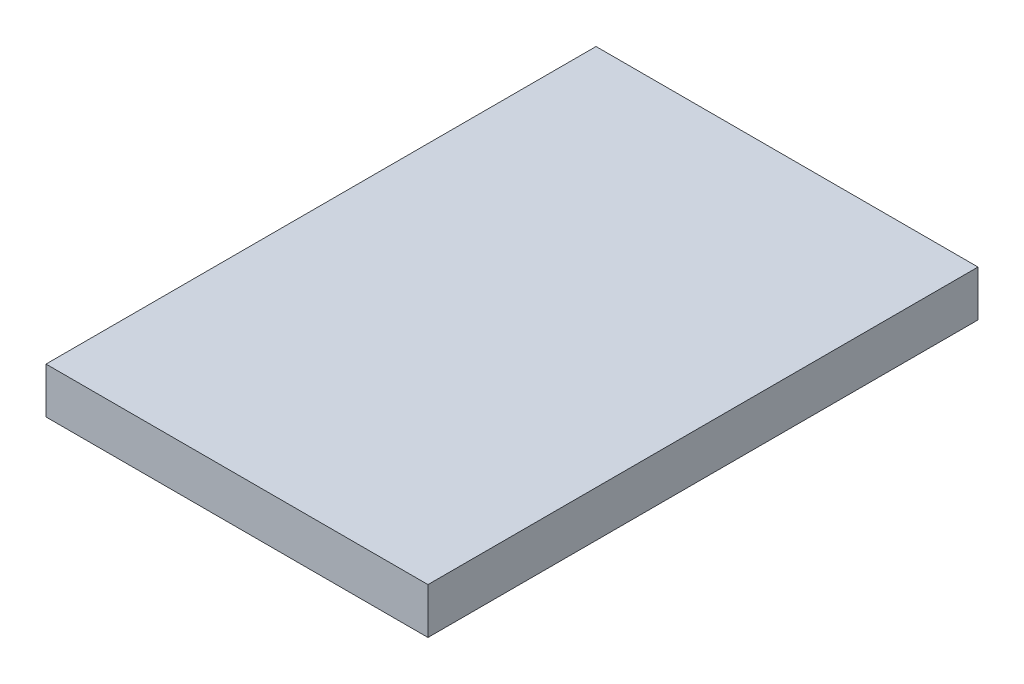
ISO-10303-21;
HEADER;
FILE_DESCRIPTION(('STEP AP214'),'2;1');
FILE_NAME('part.step','',(''),(''),'','','');
FILE_SCHEMA(('AUTOMOTIVE_DESIGN { 1 0 10303 214 1 1 1 1 }'));
ENDSEC;
DATA;
#1=APPLICATION_CONTEXT('core data for automotive mechanical design processes');
#2=APPLICATION_PROTOCOL_DEFINITION('international standard','automotive_design',2000,#1);
#3=PRODUCT_CONTEXT('',#1,'mechanical');
#4=PRODUCT('Part','Part','',(#3));
#5=PRODUCT_RELATED_PRODUCT_CATEGORY('part','',(#4));
#6=PRODUCT_DEFINITION_FORMATION('','',#4);
#7=PRODUCT_DEFINITION_CONTEXT('part definition',#1,'design');
#8=PRODUCT_DEFINITION('design','',#6,#7);
#9=PRODUCT_DEFINITION_SHAPE('','',#8);
#10=(LENGTH_UNIT() NAMED_UNIT(*) SI_UNIT(.MILLI.,.METRE.));
#11=(NAMED_UNIT(*) PLANE_ANGLE_UNIT() SI_UNIT($,.RADIAN.));
#12=(NAMED_UNIT(*) SI_UNIT($,.STERADIAN.) SOLID_ANGLE_UNIT());
#13=UNCERTAINTY_MEASURE_WITH_UNIT(LENGTH_MEASURE(1.E-05),#10,'distance_accuracy_value','');
#14=(GEOMETRIC_REPRESENTATION_CONTEXT(3) GLOBAL_UNCERTAINTY_ASSIGNED_CONTEXT((#13)) GLOBAL_UNIT_ASSIGNED_CONTEXT((#10,
#11,#12)) REPRESENTATION_CONTEXT('',''));
#15=CARTESIAN_POINT('',(0.,0.,0.));
#16=DIRECTION('',(0.,0.,1.));
#17=DIRECTION('',(1.,0.,0.));
#18=AXIS2_PLACEMENT_3D('',#15,#16,#17);
#19=CARTESIAN_POINT('',(12.5,3.,-18.));
#20=DIRECTION('',(-1.,0.,0.));
#21=DIRECTION('',(0.,0.,1.));
#22=AXIS2_PLACEMENT_3D('',#19,#20,#21);
#23=PLANE('',#22);
#24=DIRECTION('',(0.,0.,-1.));
#25=VECTOR('',#24,1.);
#26=CARTESIAN_POINT('',(12.5,0.,-18.));
#27=LINE('',#26,#25);
#28=CARTESIAN_POINT('',(12.5,0.,18.));
#29=VERTEX_POINT('',#28);
#30=CARTESIAN_POINT('',(12.5,0.,-18.));
#31=VERTEX_POINT('',#30);
#32=EDGE_CURVE('E98',#29,#31,#27,.T.);
#33=ORIENTED_EDGE('',*,*,#32,.T.);
#34=DIRECTION('',(0.,-1.,0.));
#35=VECTOR('',#34,1.);
#36=CARTESIAN_POINT('',(12.5,3.,-18.));
#37=LINE('',#36,#35);
#38=CARTESIAN_POINT('',(12.5,3.,-18.));
#39=VERTEX_POINT('',#38);
#40=EDGE_CURVE('E11',#39,#31,#37,.T.);
#41=ORIENTED_EDGE('',*,*,#40,.F.);
#42=DIRECTION('',(0.,0.,-1.));
#43=VECTOR('',#42,1.);
#44=CARTESIAN_POINT('',(12.5,3.,-18.));
#45=LINE('',#44,#43);
#46=CARTESIAN_POINT('',(12.5,3.,18.));
#47=VERTEX_POINT('',#46);
#48=EDGE_CURVE('E86',#47,#39,#45,.T.);
#49=ORIENTED_EDGE('',*,*,#48,.F.);
#50=DIRECTION('',(0.,-1.,0.));
#51=VECTOR('',#50,1.);
#52=CARTESIAN_POINT('',(12.5,3.,18.));
#53=LINE('',#52,#51);
#54=EDGE_CURVE('E94',#47,#29,#53,.T.);
#55=ORIENTED_EDGE('',*,*,#54,.T.);
#56=EDGE_LOOP('',(#33,#41,#49,#55));
#57=FACE_BOUND('',#56,.T.);
#58=ADVANCED_FACE('F35',(#57),#23,.F.);
#59=CARTESIAN_POINT('',(-12.5,3.,-18.));
#60=DIRECTION('',(0.,0.,1.));
#61=DIRECTION('',(1.,0.,0.));
#62=AXIS2_PLACEMENT_3D('',#59,#60,#61);
#63=PLANE('',#62);
#64=DIRECTION('',(-1.,0.,0.));
#65=VECTOR('',#64,1.);
#66=CARTESIAN_POINT('',(-12.5,0.,-18.));
#67=LINE('',#66,#65);
#68=CARTESIAN_POINT('',(-12.5,0.,-18.));
#69=VERTEX_POINT('',#68);
#70=EDGE_CURVE('E90',#31,#69,#67,.T.);
#71=ORIENTED_EDGE('',*,*,#70,.T.);
#72=DIRECTION('',(0.,-1.,0.));
#73=VECTOR('',#72,1.);
#74=CARTESIAN_POINT('',(-12.5,3.,-18.));
#75=LINE('',#74,#73);
#76=CARTESIAN_POINT('',(-12.5,3.,-18.));
#77=VERTEX_POINT('',#76);
#78=EDGE_CURVE('E43',#77,#69,#75,.T.);
#79=ORIENTED_EDGE('',*,*,#78,.F.);
#80=DIRECTION('',(-1.,0.,0.));
#81=VECTOR('',#80,1.);
#82=CARTESIAN_POINT('',(-12.5,3.,-18.));
#83=LINE('',#82,#81);
#84=EDGE_CURVE('E81',#39,#77,#83,.T.);
#85=ORIENTED_EDGE('',*,*,#84,.F.);
#86=ORIENTED_EDGE('',*,*,#40,.T.);
#87=EDGE_LOOP('',(#71,#79,#85,#86));
#88=FACE_BOUND('',#87,.T.);
#89=ADVANCED_FACE('F89',(#88),#63,.F.);
#90=CARTESIAN_POINT('',(-12.5,3.,-18.));
#91=DIRECTION('',(1.,0.,0.));
#92=DIRECTION('',(0.,0.,-1.));
#93=AXIS2_PLACEMENT_3D('',#90,#91,#92);
#94=PLANE('',#93);
#95=DIRECTION('',(0.,0.,1.));
#96=VECTOR('',#95,1.);
#97=CARTESIAN_POINT('',(-12.5,0.,-18.));
#98=LINE('',#97,#96);
#99=CARTESIAN_POINT('',(-12.5,0.,18.));
#100=VERTEX_POINT('',#99);
#101=EDGE_CURVE('E68',#69,#100,#98,.T.);
#102=ORIENTED_EDGE('',*,*,#101,.T.);
#103=DIRECTION('',(0.,-1.,0.));
#104=VECTOR('',#103,1.);
#105=CARTESIAN_POINT('',(-12.5,3.,18.));
#106=LINE('',#105,#104);
#107=CARTESIAN_POINT('',(-12.5,3.,18.));
#108=VERTEX_POINT('',#107);
#109=EDGE_CURVE('E91',#108,#100,#106,.T.);
#110=ORIENTED_EDGE('',*,*,#109,.F.);
#111=DIRECTION('',(0.,0.,1.));
#112=VECTOR('',#111,1.);
#113=CARTESIAN_POINT('',(-12.5,3.,-18.));
#114=LINE('',#113,#112);
#115=EDGE_CURVE('E84',#77,#108,#114,.T.);
#116=ORIENTED_EDGE('',*,*,#115,.F.);
#117=ORIENTED_EDGE('',*,*,#78,.T.);
#118=EDGE_LOOP('',(#102,#110,#116,#117));
#119=FACE_BOUND('',#118,.T.);
#120=ADVANCED_FACE('F92',(#119),#94,.F.);
#121=CARTESIAN_POINT('',(-12.5,3.,18.));
#122=DIRECTION('',(0.,0.,-1.));
#123=DIRECTION('',(-1.,0.,0.));
#124=AXIS2_PLACEMENT_3D('',#121,#122,#123);
#125=PLANE('',#124);
#126=DIRECTION('',(1.,0.,0.));
#127=VECTOR('',#126,1.);
#128=CARTESIAN_POINT('',(-12.5,0.,18.));
#129=LINE('',#128,#127);
#130=EDGE_CURVE('E74',#100,#29,#129,.T.);
#131=ORIENTED_EDGE('',*,*,#130,.T.);
#132=ORIENTED_EDGE('',*,*,#54,.F.);
#133=DIRECTION('',(1.,0.,0.));
#134=VECTOR('',#133,1.);
#135=CARTESIAN_POINT('',(-12.5,3.,18.));
#136=LINE('',#135,#134);
#137=EDGE_CURVE('E51',#108,#47,#136,.T.);
#138=ORIENTED_EDGE('',*,*,#137,.F.);
#139=ORIENTED_EDGE('',*,*,#109,.T.);
#140=EDGE_LOOP('',(#131,#132,#138,#139));
#141=FACE_BOUND('',#140,.T.);
#142=ADVANCED_FACE('F105',(#141),#125,.F.);
#143=CARTESIAN_POINT('',(0.,3.,0.));
#144=DIRECTION('',(0.,1.,0.));
#145=DIRECTION('',(0.,0.,1.));
#146=AXIS2_PLACEMENT_3D('',#143,#144,#145);
#147=PLANE('',#146);
#148=ORIENTED_EDGE('',*,*,#48,.T.);
#149=ORIENTED_EDGE('',*,*,#84,.T.);
#150=ORIENTED_EDGE('',*,*,#115,.T.);
#151=ORIENTED_EDGE('',*,*,#137,.T.);
#152=EDGE_LOOP('',(#148,#149,#150,#151));
#153=FACE_BOUND('',#152,.T.);
#154=ADVANCED_FACE('F82',(#153),#147,.T.);
#155=CARTESIAN_POINT('',(0.,0.,0.));
#156=DIRECTION('',(0.,1.,0.));
#157=DIRECTION('',(0.,0.,1.));
#158=AXIS2_PLACEMENT_3D('',#155,#156,#157);
#159=PLANE('',#158);
#160=ORIENTED_EDGE('',*,*,#32,.F.);
#161=ORIENTED_EDGE('',*,*,#130,.F.);
#162=ORIENTED_EDGE('',*,*,#101,.F.);
#163=ORIENTED_EDGE('',*,*,#70,.F.);
#164=EDGE_LOOP('',(#160,#161,#162,#163));
#165=FACE_BOUND('',#164,.T.);
#166=ADVANCED_FACE('F108',(#165),#159,.F.);
#167=CLOSED_SHELL('',(#58,#89,#120,#142,#154,#166));
#168=MANIFOLD_SOLID_BREP('B2',#167);
#169=ADVANCED_BREP_SHAPE_REPRESENTATION('',(#18,#168),#14);
#170=SHAPE_DEFINITION_REPRESENTATION(#9,#169);
ENDSEC;
END-ISO-10303-21;
